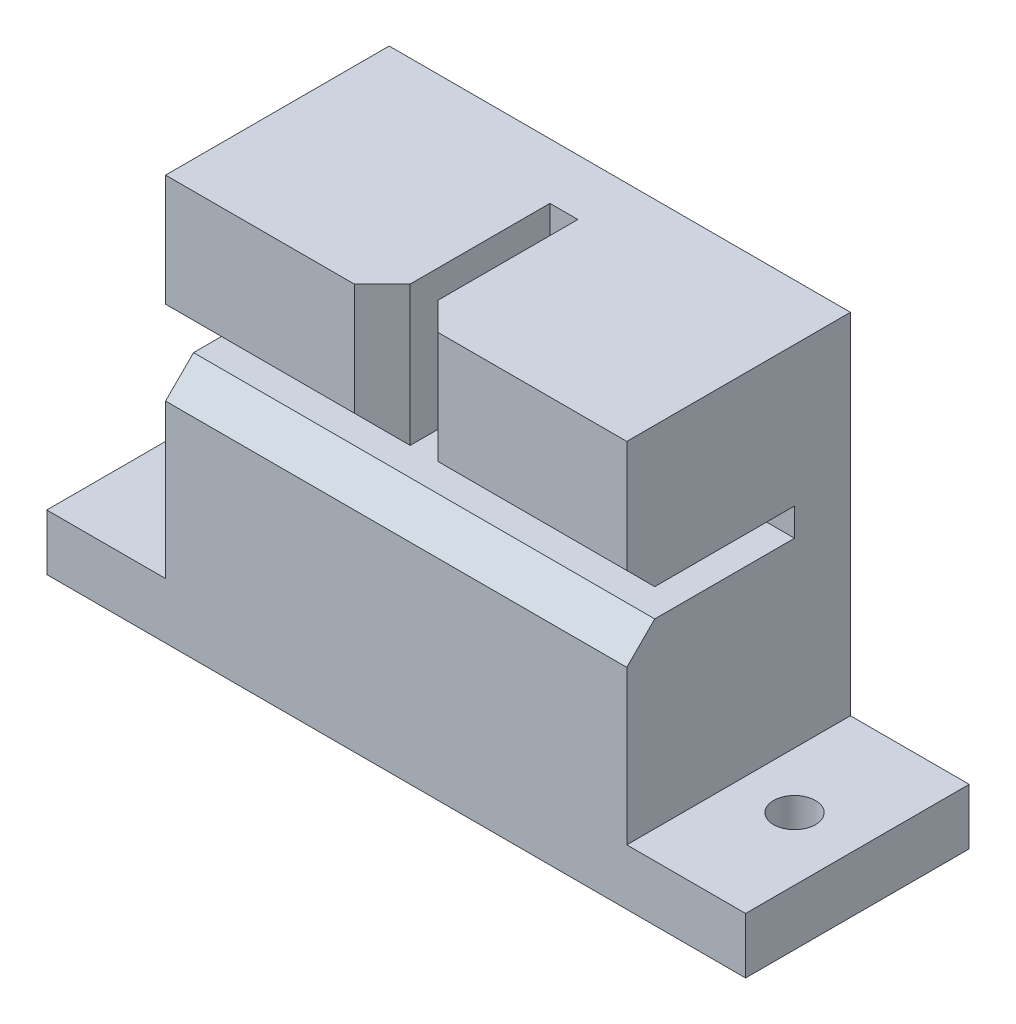
ISO-10303-21;
HEADER;
FILE_DESCRIPTION(('STEP AP214'),'2;1');
FILE_NAME('part.step','',(''),(''),'','','');
FILE_SCHEMA(('AUTOMOTIVE_DESIGN { 1 0 10303 214 1 1 1 1 }'));
ENDSEC;
DATA;
#1=APPLICATION_CONTEXT('core data for automotive mechanical design processes');
#2=APPLICATION_PROTOCOL_DEFINITION('international standard','automotive_design',2000,#1);
#3=PRODUCT_CONTEXT('',#1,'mechanical');
#4=PRODUCT('Part','Part','',(#3));
#5=PRODUCT_RELATED_PRODUCT_CATEGORY('part','',(#4));
#6=PRODUCT_DEFINITION_FORMATION('','',#4);
#7=PRODUCT_DEFINITION_CONTEXT('part definition',#1,'design');
#8=PRODUCT_DEFINITION('design','',#6,#7);
#9=PRODUCT_DEFINITION_SHAPE('','',#8);
#10=(LENGTH_UNIT() NAMED_UNIT(*) SI_UNIT(.MILLI.,.METRE.));
#11=(NAMED_UNIT(*) PLANE_ANGLE_UNIT() SI_UNIT($,.RADIAN.));
#12=(NAMED_UNIT(*) SI_UNIT($,.STERADIAN.) SOLID_ANGLE_UNIT());
#13=UNCERTAINTY_MEASURE_WITH_UNIT(LENGTH_MEASURE(1.E-05),#10,'distance_accuracy_value','');
#14=(GEOMETRIC_REPRESENTATION_CONTEXT(3) GLOBAL_UNCERTAINTY_ASSIGNED_CONTEXT((#13)) GLOBAL_UNIT_ASSIGNED_CONTEXT((#10,
#11,#12)) REPRESENTATION_CONTEXT('',''));
#15=CARTESIAN_POINT('',(0.,0.,0.));
#16=DIRECTION('',(0.,0.,1.));
#17=DIRECTION('',(1.,0.,0.));
#18=AXIS2_PLACEMENT_3D('',#15,#16,#17);
#19=CARTESIAN_POINT('',(0.,14.5,-16.));
#20=DIRECTION('',(0.,-1.,0.));
#21=DIRECTION('',(0.,0.,-1.));
#22=AXIS2_PLACEMENT_3D('',#19,#20,#21);
#23=PLANE('',#22);
#24=DIRECTION('',(0.,0.,1.));
#25=VECTOR('',#24,1.);
#26=CARTESIAN_POINT('',(1.,14.5,-12.));
#27=LINE('',#26,#25);
#28=CARTESIAN_POINT('',(1.,14.5,-12.));
#29=VERTEX_POINT('',#28);
#30=CARTESIAN_POINT('',(1.,14.5,-2.));
#31=VERTEX_POINT('',#30);
#32=EDGE_CURVE('E218',#29,#31,#27,.T.);
#33=ORIENTED_EDGE('',*,*,#32,.T.);
#34=DIRECTION('',(0.707106781186546,0.,0.707106781186549));
#35=VECTOR('',#34,1.);
#36=CARTESIAN_POINT('',(1.,14.5,-2.));
#37=LINE('',#36,#35);
#38=CARTESIAN_POINT('',(2.99999999999999,14.5,0.));
#39=VERTEX_POINT('',#38);
#40=EDGE_CURVE('E302',#31,#39,#37,.T.);
#41=ORIENTED_EDGE('',*,*,#40,.T.);
#42=DIRECTION('',(1.,0.,0.));
#43=VECTOR('',#42,1.);
#44=CARTESIAN_POINT('',(0.,14.5,0.));
#45=LINE('',#44,#43);
#46=CARTESIAN_POINT('',(16.5,14.5,0.));
#47=VERTEX_POINT('',#46);
#48=EDGE_CURVE('E261',#39,#47,#45,.T.);
#49=ORIENTED_EDGE('',*,*,#48,.T.);
#50=DIRECTION('',(0.,0.,1.));
#51=VECTOR('',#50,1.);
#52=CARTESIAN_POINT('',(16.5,14.5,-16.));
#53=LINE('',#52,#51);
#54=CARTESIAN_POINT('',(16.5,14.5,-16.));
#55=VERTEX_POINT('',#54);
#56=EDGE_CURVE('E293',#55,#47,#53,.T.);
#57=ORIENTED_EDGE('',*,*,#56,.F.);
#58=DIRECTION('',(1.,0.,0.));
#59=VECTOR('',#58,1.);
#60=CARTESIAN_POINT('',(0.,14.5,-16.));
#61=LINE('',#60,#59);
#62=CARTESIAN_POINT('',(-16.5,14.5,-16.));
#63=VERTEX_POINT('',#62);
#64=EDGE_CURVE('E239',#63,#55,#61,.T.);
#65=ORIENTED_EDGE('',*,*,#64,.F.);
#66=DIRECTION('',(0.,0.,1.));
#67=VECTOR('',#66,1.);
#68=CARTESIAN_POINT('',(-16.5,14.5,-16.));
#69=LINE('',#68,#67);
#70=CARTESIAN_POINT('',(-16.5,14.5,0.));
#71=VERTEX_POINT('',#70);
#72=EDGE_CURVE('E291',#63,#71,#69,.T.);
#73=ORIENTED_EDGE('',*,*,#72,.T.);
#74=CARTESIAN_POINT('',(-3.,14.5,0.));
#75=VERTEX_POINT('',#74);
#76=EDGE_CURVE('E262',#71,#75,#45,.T.);
#77=ORIENTED_EDGE('',*,*,#76,.T.);
#78=DIRECTION('',(-0.707106781186546,0.,0.707106781186549));
#79=VECTOR('',#78,1.);
#80=CARTESIAN_POINT('',(-3.,14.5,0.));
#81=LINE('',#80,#79);
#82=CARTESIAN_POINT('',(-1.,14.5,-2.));
#83=VERTEX_POINT('',#82);
#84=EDGE_CURVE('E300',#75,#83,#81,.F.);
#85=ORIENTED_EDGE('',*,*,#84,.T.);
#86=DIRECTION('',(0.,0.,1.));
#87=VECTOR('',#86,1.);
#88=CARTESIAN_POINT('',(-1.,14.5,-12.));
#89=LINE('',#88,#87);
#90=CARTESIAN_POINT('',(-1.,14.5,-12.));
#91=VERTEX_POINT('',#90);
#92=EDGE_CURVE('E215',#91,#83,#89,.T.);
#93=ORIENTED_EDGE('',*,*,#92,.F.);
#94=DIRECTION('',(-1.,0.,0.));
#95=VECTOR('',#94,1.);
#96=CARTESIAN_POINT('',(0.,14.5,-12.));
#97=LINE('',#96,#95);
#98=EDGE_CURVE('E190',#29,#91,#97,.T.);
#99=ORIENTED_EDGE('',*,*,#98,.F.);
#100=EDGE_LOOP('',(#33,#41,#49,#57,#65,#73,#77,#85,#93,#99));
#101=FACE_BOUND('',#100,.T.);
#102=ADVANCED_FACE('F35',(#101),#23,.F.);
#103=CARTESIAN_POINT('',(16.5,0.,-16.));
#104=DIRECTION('',(-1.,0.,0.));
#105=DIRECTION('',(0.,0.,1.));
#106=AXIS2_PLACEMENT_3D('',#103,#104,#105);
#107=PLANE('',#106);
#108=DIRECTION('',(0.,-1.,0.));
#109=VECTOR('',#108,1.);
#110=CARTESIAN_POINT('',(16.5,0.,0.));
#111=LINE('',#110,#109);
#112=CARTESIAN_POINT('',(16.5,6.49999999999999,0.));
#113=VERTEX_POINT('',#112);
#114=EDGE_CURVE('E258',#47,#113,#111,.T.);
#115=ORIENTED_EDGE('',*,*,#114,.T.);
#116=DIRECTION('',(0.,0.707106781186546,0.707106781186549));
#117=VECTOR('',#116,1.);
#118=CARTESIAN_POINT('',(16.5,6.49999999999999,0.));
#119=LINE('',#118,#117);
#120=CARTESIAN_POINT('',(16.5,4.5,-2.));
#121=VERTEX_POINT('',#120);
#122=EDGE_CURVE('E310',#113,#121,#119,.F.);
#123=ORIENTED_EDGE('',*,*,#122,.T.);
#124=DIRECTION('',(0.,0.,1.));
#125=VECTOR('',#124,1.);
#126=CARTESIAN_POINT('',(16.5,4.5,-12.));
#127=LINE('',#126,#125);
#128=CARTESIAN_POINT('',(16.5,4.5,-12.));
#129=VERTEX_POINT('',#128);
#130=EDGE_CURVE('E224',#129,#121,#127,.T.);
#131=ORIENTED_EDGE('',*,*,#130,.F.);
#132=DIRECTION('',(0.,1.,0.));
#133=VECTOR('',#132,1.);
#134=CARTESIAN_POINT('',(16.5,0.,-12.));
#135=LINE('',#134,#133);
#136=CARTESIAN_POINT('',(16.5,2.5,-12.));
#137=VERTEX_POINT('',#136);
#138=EDGE_CURVE('E207',#137,#129,#135,.T.);
#139=ORIENTED_EDGE('',*,*,#138,.F.);
#140=DIRECTION('',(0.,0.,1.));
#141=VECTOR('',#140,1.);
#142=CARTESIAN_POINT('',(16.5,2.5,-12.));
#143=LINE('',#142,#141);
#144=CARTESIAN_POINT('',(16.5,2.5,-1.99999999999999));
#145=VERTEX_POINT('',#144);
#146=EDGE_CURVE('E227',#137,#145,#143,.T.);
#147=ORIENTED_EDGE('',*,*,#146,.T.);
#148=DIRECTION('',(0.,-0.707106781186549,0.707106781186546));
#149=VECTOR('',#148,1.);
#150=CARTESIAN_POINT('',(16.5,2.5,-1.99999999999999));
#151=LINE('',#150,#149);
#152=CARTESIAN_POINT('',(16.5,0.499999999999995,0.));
#153=VERTEX_POINT('',#152);
#154=EDGE_CURVE('E308',#145,#153,#151,.T.);
#155=ORIENTED_EDGE('',*,*,#154,.T.);
#156=CARTESIAN_POINT('',(16.5,-10.5,0.));
#157=VERTEX_POINT('',#156);
#158=EDGE_CURVE('E257',#153,#157,#111,.T.);
#159=ORIENTED_EDGE('',*,*,#158,.T.);
#160=DIRECTION('',(0.,0.,1.));
#161=VECTOR('',#160,1.);
#162=CARTESIAN_POINT('',(16.5,-10.5,-16.));
#163=LINE('',#162,#161);
#164=CARTESIAN_POINT('',(16.5,-10.5,-16.));
#165=VERTEX_POINT('',#164);
#166=EDGE_CURVE('E254',#165,#157,#163,.T.);
#167=ORIENTED_EDGE('',*,*,#166,.F.);
#168=DIRECTION('',(0.,-1.,0.));
#169=VECTOR('',#168,1.);
#170=CARTESIAN_POINT('',(16.5,0.,-16.));
#171=LINE('',#170,#169);
#172=EDGE_CURVE('E236',#55,#165,#171,.T.);
#173=ORIENTED_EDGE('',*,*,#172,.F.);
#174=ORIENTED_EDGE('',*,*,#56,.T.);
#175=EDGE_LOOP('',(#115,#123,#131,#139,#147,#155,#159,#167,#173,#174));
#176=FACE_BOUND('',#175,.T.);
#177=ADVANCED_FACE('F393',(#176),#107,.F.);
#178=CARTESIAN_POINT('',(0.,0.,0.));
#179=DIRECTION('',(0.,0.,1.));
#180=DIRECTION('',(1.,0.,0.));
#181=AXIS2_PLACEMENT_3D('',#178,#179,#180);
#182=PLANE('',#181);
#183=ORIENTED_EDGE('',*,*,#48,.F.);
#184=DIRECTION('',(0.,-1.,0.));
#185=VECTOR('',#184,1.);
#186=CARTESIAN_POINT('',(2.99999999999999,4.5,0.));
#187=LINE('',#186,#185);
#188=CARTESIAN_POINT('',(2.99999999999999,6.49999999999999,0.));
#189=VERTEX_POINT('',#188);
#190=EDGE_CURVE('E306',#39,#189,#187,.T.);
#191=ORIENTED_EDGE('',*,*,#190,.T.);
#192=DIRECTION('',(1.,0.,0.));
#193=VECTOR('',#192,1.);
#194=CARTESIAN_POINT('',(0.,6.49999999999999,0.));
#195=LINE('',#194,#193);
#196=EDGE_CURVE('E304',#189,#113,#195,.T.);
#197=ORIENTED_EDGE('',*,*,#196,.T.);
#198=ORIENTED_EDGE('',*,*,#114,.F.);
#199=EDGE_LOOP('',(#183,#191,#197,#198));
#200=FACE_BOUND('',#199,.T.);
#201=ADVANCED_FACE('F424',(#200),#182,.T.);
#202=DIRECTION('',(1.,0.,0.));
#203=VECTOR('',#202,1.);
#204=CARTESIAN_POINT('',(0.,6.49999999999999,0.));
#205=LINE('',#204,#203);
#206=CARTESIAN_POINT('',(-16.5,6.49999999999999,0.));
#207=VERTEX_POINT('',#206);
#208=CARTESIAN_POINT('',(-3.,6.49999999999999,0.));
#209=VERTEX_POINT('',#208);
#210=EDGE_CURVE('E59',#207,#209,#205,.T.);
#211=ORIENTED_EDGE('',*,*,#210,.T.);
#212=DIRECTION('',(0.,1.,0.));
#213=VECTOR('',#212,1.);
#214=CARTESIAN_POINT('',(-3.,0.,0.));
#215=LINE('',#214,#213);
#216=EDGE_CURVE('E324',#209,#75,#215,.T.);
#217=ORIENTED_EDGE('',*,*,#216,.T.);
#218=ORIENTED_EDGE('',*,*,#76,.F.);
#219=DIRECTION('',(0.,-1.,0.));
#220=VECTOR('',#219,1.);
#221=CARTESIAN_POINT('',(-16.5,0.,0.));
#222=LINE('',#221,#220);
#223=EDGE_CURVE('E266',#71,#207,#222,.T.);
#224=ORIENTED_EDGE('',*,*,#223,.T.);
#225=EDGE_LOOP('',(#211,#217,#218,#224));
#226=FACE_BOUND('',#225,.T.);
#227=ADVANCED_FACE('F328',(#226),#182,.T.);
#228=CARTESIAN_POINT('',(0.,-10.5,-16.));
#229=DIRECTION('',(0.,-1.,0.));
#230=DIRECTION('',(0.,0.,-1.));
#231=AXIS2_PLACEMENT_3D('',#228,#229,#230);
#232=PLANE('',#231);
#233=CARTESIAN_POINT('',(20.5,-10.5,-7.99999999999999));
#234=DIRECTION('',(0.,-1.,0.));
#235=DIRECTION('',(0.,0.,-1.));
#236=AXIS2_PLACEMENT_3D('',#233,#234,#235);
#237=CIRCLE('',#236,1.5);
#238=CARTESIAN_POINT('',(20.5,-10.5,-9.5));
#239=VERTEX_POINT('',#238);
#240=EDGE_CURVE('E346',#239,#239,#237,.F.);
#241=ORIENTED_EDGE('',*,*,#240,.F.);
#242=EDGE_LOOP('',(#241));
#243=FACE_BOUND('',#242,.T.);
#244=DIRECTION('',(1.,0.,0.));
#245=VECTOR('',#244,1.);
#246=CARTESIAN_POINT('',(0.,-10.5,0.));
#247=LINE('',#246,#245);
#248=CARTESIAN_POINT('',(25.,-10.5,0.));
#249=VERTEX_POINT('',#248);
#250=EDGE_CURVE('E217',#157,#249,#247,.T.);
#251=ORIENTED_EDGE('',*,*,#250,.T.);
#252=DIRECTION('',(0.,0.,1.));
#253=VECTOR('',#252,1.);
#254=CARTESIAN_POINT('',(25.,-10.5,-16.));
#255=LINE('',#254,#253);
#256=CARTESIAN_POINT('',(25.,-10.5,-16.));
#257=VERTEX_POINT('',#256);
#258=EDGE_CURVE('E278',#257,#249,#255,.T.);
#259=ORIENTED_EDGE('',*,*,#258,.F.);
#260=DIRECTION('',(1.,0.,0.));
#261=VECTOR('',#260,1.);
#262=CARTESIAN_POINT('',(0.,-10.5,-16.));
#263=LINE('',#262,#261);
#264=EDGE_CURVE('E234',#165,#257,#263,.T.);
#265=ORIENTED_EDGE('',*,*,#264,.F.);
#266=ORIENTED_EDGE('',*,*,#166,.T.);
#267=EDGE_LOOP('',(#251,#259,#265,#266));
#268=FACE_BOUND('',#267,.T.);
#269=ADVANCED_FACE('F379',(#243,#268),#232,.F.);
#270=CARTESIAN_POINT('',(25.,0.,-16.));
#271=DIRECTION('',(1.,0.,0.));
#272=DIRECTION('',(0.,0.,-1.));
#273=AXIS2_PLACEMENT_3D('',#270,#271,#272);
#274=PLANE('',#273);
#275=DIRECTION('',(0.,1.,0.));
#276=VECTOR('',#275,1.);
#277=CARTESIAN_POINT('',(25.,0.,0.));
#278=LINE('',#277,#276);
#279=CARTESIAN_POINT('',(25.,-14.5,0.));
#280=VERTEX_POINT('',#279);
#281=EDGE_CURVE('E237',#280,#249,#278,.T.);
#282=ORIENTED_EDGE('',*,*,#281,.F.);
#283=DIRECTION('',(0.,0.,1.));
#284=VECTOR('',#283,1.);
#285=CARTESIAN_POINT('',(25.,-14.5,-16.));
#286=LINE('',#285,#284);
#287=CARTESIAN_POINT('',(25.,-14.5,-16.));
#288=VERTEX_POINT('',#287);
#289=EDGE_CURVE('E281',#288,#280,#286,.T.);
#290=ORIENTED_EDGE('',*,*,#289,.F.);
#291=DIRECTION('',(0.,1.,0.));
#292=VECTOR('',#291,1.);
#293=CARTESIAN_POINT('',(25.,0.,-16.));
#294=LINE('',#293,#292);
#295=EDGE_CURVE('E251',#288,#257,#294,.T.);
#296=ORIENTED_EDGE('',*,*,#295,.T.);
#297=ORIENTED_EDGE('',*,*,#258,.T.);
#298=EDGE_LOOP('',(#282,#290,#296,#297));
#299=FACE_BOUND('',#298,.T.);
#300=ADVANCED_FACE('F362',(#299),#274,.T.);
#301=CARTESIAN_POINT('',(0.,-14.5,-16.));
#302=DIRECTION('',(0.,-1.,0.));
#303=DIRECTION('',(0.,0.,-1.));
#304=AXIS2_PLACEMENT_3D('',#301,#302,#303);
#305=PLANE('',#304);
#306=CARTESIAN_POINT('',(20.5,-14.5,-7.99999999999999));
#307=DIRECTION('',(0.,-1.,0.));
#308=DIRECTION('',(0.,0.,1.));
#309=AXIS2_PLACEMENT_3D('',#306,#307,#308);
#310=CIRCLE('',#309,1.5);
#311=CARTESIAN_POINT('',(20.5,-14.5,-6.49999999999999));
#312=VERTEX_POINT('',#311);
#313=EDGE_CURVE('E350',#312,#312,#310,.T.);
#314=ORIENTED_EDGE('',*,*,#313,.F.);
#315=EDGE_LOOP('',(#314));
#316=FACE_BOUND('',#315,.T.);
#317=CARTESIAN_POINT('',(-20.5,-14.5,-8.));
#318=DIRECTION('',(0.,-1.,0.));
#319=DIRECTION('',(0.,0.,-1.));
#320=AXIS2_PLACEMENT_3D('',#317,#318,#319);
#321=CIRCLE('',#320,1.5);
#322=CARTESIAN_POINT('',(-20.5,-14.5,-9.5));
#323=VERTEX_POINT('',#322);
#324=EDGE_CURVE('E342',#323,#323,#321,.T.);
#325=ORIENTED_EDGE('',*,*,#324,.F.);
#326=EDGE_LOOP('',(#325));
#327=FACE_BOUND('',#326,.T.);
#328=DIRECTION('',(1.,0.,0.));
#329=VECTOR('',#328,1.);
#330=CARTESIAN_POINT('',(0.,-14.5,0.));
#331=LINE('',#330,#329);
#332=CARTESIAN_POINT('',(-25.,-14.5,0.));
#333=VERTEX_POINT('',#332);
#334=EDGE_CURVE('E273',#333,#280,#331,.T.);
#335=ORIENTED_EDGE('',*,*,#334,.F.);
#336=DIRECTION('',(0.,0.,1.));
#337=VECTOR('',#336,1.);
#338=CARTESIAN_POINT('',(-25.,-14.5,-16.));
#339=LINE('',#338,#337);
#340=CARTESIAN_POINT('',(-25.,-14.5,-16.));
#341=VERTEX_POINT('',#340);
#342=EDGE_CURVE('E283',#341,#333,#339,.T.);
#343=ORIENTED_EDGE('',*,*,#342,.F.);
#344=DIRECTION('',(1.,0.,0.));
#345=VECTOR('',#344,1.);
#346=CARTESIAN_POINT('',(0.,-14.5,-16.));
#347=LINE('',#346,#345);
#348=EDGE_CURVE('E248',#341,#288,#347,.T.);
#349=ORIENTED_EDGE('',*,*,#348,.T.);
#350=ORIENTED_EDGE('',*,*,#289,.T.);
#351=EDGE_LOOP('',(#335,#343,#349,#350));
#352=FACE_BOUND('',#351,.T.);
#353=ADVANCED_FACE('F358',(#316,#327,#352),#305,.T.);
#354=CARTESIAN_POINT('',(-25.,0.,-16.));
#355=DIRECTION('',(1.,0.,0.));
#356=DIRECTION('',(0.,0.,-1.));
#357=AXIS2_PLACEMENT_3D('',#354,#355,#356);
#358=PLANE('',#357);
#359=DIRECTION('',(0.,1.,0.));
#360=VECTOR('',#359,1.);
#361=CARTESIAN_POINT('',(-25.,0.,0.));
#362=LINE('',#361,#360);
#363=CARTESIAN_POINT('',(-25.,-10.5,0.));
#364=VERTEX_POINT('',#363);
#365=EDGE_CURVE('E271',#333,#364,#362,.T.);
#366=ORIENTED_EDGE('',*,*,#365,.T.);
#367=DIRECTION('',(0.,0.,1.));
#368=VECTOR('',#367,1.);
#369=CARTESIAN_POINT('',(-25.,-10.5,-16.));
#370=LINE('',#369,#368);
#371=CARTESIAN_POINT('',(-25.,-10.5,-16.));
#372=VERTEX_POINT('',#371);
#373=EDGE_CURVE('E285',#372,#364,#370,.T.);
#374=ORIENTED_EDGE('',*,*,#373,.F.);
#375=DIRECTION('',(0.,1.,0.));
#376=VECTOR('',#375,1.);
#377=CARTESIAN_POINT('',(-25.,0.,-16.));
#378=LINE('',#377,#376);
#379=EDGE_CURVE('E246',#341,#372,#378,.T.);
#380=ORIENTED_EDGE('',*,*,#379,.F.);
#381=ORIENTED_EDGE('',*,*,#342,.T.);
#382=EDGE_LOOP('',(#366,#374,#380,#381));
#383=FACE_BOUND('',#382,.T.);
#384=ADVANCED_FACE('F361',(#383),#358,.F.);
#385=CARTESIAN_POINT('',(0.,-10.5,-16.));
#386=DIRECTION('',(0.,-1.,0.));
#387=DIRECTION('',(0.,0.,-1.));
#388=AXIS2_PLACEMENT_3D('',#385,#386,#387);
#389=PLANE('',#388);
#390=CARTESIAN_POINT('',(-20.5,-10.5,-8.));
#391=DIRECTION('',(0.,-1.,0.));
#392=DIRECTION('',(0.,0.,-1.));
#393=AXIS2_PLACEMENT_3D('',#390,#391,#392);
#394=CIRCLE('',#393,1.5);
#395=CARTESIAN_POINT('',(-20.5,-10.5,-9.5));
#396=VERTEX_POINT('',#395);
#397=EDGE_CURVE('E200',#396,#396,#394,.F.);
#398=ORIENTED_EDGE('',*,*,#397,.F.);
#399=EDGE_LOOP('',(#398));
#400=FACE_BOUND('',#399,.T.);
#401=DIRECTION('',(1.,0.,0.));
#402=VECTOR('',#401,1.);
#403=CARTESIAN_POINT('',(0.,-10.5,0.));
#404=LINE('',#403,#402);
#405=CARTESIAN_POINT('',(-16.5,-10.5,0.));
#406=VERTEX_POINT('',#405);
#407=EDGE_CURVE('E268',#364,#406,#404,.T.);
#408=ORIENTED_EDGE('',*,*,#407,.T.);
#409=DIRECTION('',(0.,0.,1.));
#410=VECTOR('',#409,1.);
#411=CARTESIAN_POINT('',(-16.5,-10.5,-16.));
#412=LINE('',#411,#410);
#413=CARTESIAN_POINT('',(-16.5,-10.5,-16.));
#414=VERTEX_POINT('',#413);
#415=EDGE_CURVE('E288',#414,#406,#412,.T.);
#416=ORIENTED_EDGE('',*,*,#415,.F.);
#417=DIRECTION('',(1.,0.,0.));
#418=VECTOR('',#417,1.);
#419=CARTESIAN_POINT('',(0.,-10.5,-16.));
#420=LINE('',#419,#418);
#421=EDGE_CURVE('E244',#372,#414,#420,.T.);
#422=ORIENTED_EDGE('',*,*,#421,.F.);
#423=ORIENTED_EDGE('',*,*,#373,.T.);
#424=EDGE_LOOP('',(#408,#416,#422,#423));
#425=FACE_BOUND('',#424,.T.);
#426=ADVANCED_FACE('F472',(#400,#425),#389,.F.);
#427=CARTESIAN_POINT('',(-16.5,0.,-16.));
#428=DIRECTION('',(-1.,0.,0.));
#429=DIRECTION('',(0.,0.,1.));
#430=AXIS2_PLACEMENT_3D('',#427,#428,#429);
#431=PLANE('',#430);
#432=CARTESIAN_POINT('',(-16.5,0.499999999999998,0.));
#433=VERTEX_POINT('',#432);
#434=EDGE_CURVE('E265',#433,#406,#222,.T.);
#435=ORIENTED_EDGE('',*,*,#434,.F.);
#436=DIRECTION('',(0.,0.707106781186549,-0.707106781186546));
#437=VECTOR('',#436,1.);
#438=CARTESIAN_POINT('',(-16.5,8.25,-7.74999999999997));
#439=LINE('',#438,#437);
#440=CARTESIAN_POINT('',(-16.5,2.5,-1.99999999999999));
#441=VERTEX_POINT('',#440);
#442=EDGE_CURVE('E321',#433,#441,#439,.T.);
#443=ORIENTED_EDGE('',*,*,#442,.T.);
#444=DIRECTION('',(0.,0.,1.));
#445=VECTOR('',#444,1.);
#446=CARTESIAN_POINT('',(-16.5,2.5,-12.));
#447=LINE('',#446,#445);
#448=CARTESIAN_POINT('',(-16.5,2.5,-12.));
#449=VERTEX_POINT('',#448);
#450=EDGE_CURVE('E230',#449,#441,#447,.T.);
#451=ORIENTED_EDGE('',*,*,#450,.F.);
#452=DIRECTION('',(0.,-1.,0.));
#453=VECTOR('',#452,1.);
#454=CARTESIAN_POINT('',(-16.5,0.,-12.));
#455=LINE('',#454,#453);
#456=CARTESIAN_POINT('',(-16.5,4.5,-12.));
#457=VERTEX_POINT('',#456);
#458=EDGE_CURVE('E185',#457,#449,#455,.T.);
#459=ORIENTED_EDGE('',*,*,#458,.F.);
#460=DIRECTION('',(0.,0.,1.));
#461=VECTOR('',#460,1.);
#462=CARTESIAN_POINT('',(-16.5,4.5,-12.));
#463=LINE('',#462,#461);
#464=CARTESIAN_POINT('',(-16.5,4.5,-2.));
#465=VERTEX_POINT('',#464);
#466=EDGE_CURVE('E180',#457,#465,#463,.T.);
#467=ORIENTED_EDGE('',*,*,#466,.T.);
#468=DIRECTION('',(0.,-0.707106781186546,-0.707106781186549));
#469=VECTOR('',#468,1.);
#470=CARTESIAN_POINT('',(-16.5,-4.74999999999999,-11.25));
#471=LINE('',#470,#469);
#472=EDGE_CURVE('E319',#465,#207,#471,.F.);
#473=ORIENTED_EDGE('',*,*,#472,.T.);
#474=ORIENTED_EDGE('',*,*,#223,.F.);
#475=ORIENTED_EDGE('',*,*,#72,.F.);
#476=DIRECTION('',(0.,-1.,0.));
#477=VECTOR('',#476,1.);
#478=CARTESIAN_POINT('',(-16.5,0.,-16.));
#479=LINE('',#478,#477);
#480=EDGE_CURVE('E241',#63,#414,#479,.T.);
#481=ORIENTED_EDGE('',*,*,#480,.T.);
#482=ORIENTED_EDGE('',*,*,#415,.T.);
#483=EDGE_LOOP('',(#435,#443,#451,#459,#467,#473,#474,#475,#481,#482));
#484=FACE_BOUND('',#483,.T.);
#485=ADVANCED_FACE('F338',(#484),#431,.T.);
#486=CARTESIAN_POINT('',(0.,0.,-16.));
#487=DIRECTION('',(0.,0.,1.));
#488=DIRECTION('',(1.,0.,0.));
#489=AXIS2_PLACEMENT_3D('',#486,#487,#488);
#490=PLANE('',#489);
#491=ORIENTED_EDGE('',*,*,#264,.T.);
#492=ORIENTED_EDGE('',*,*,#295,.F.);
#493=ORIENTED_EDGE('',*,*,#348,.F.);
#494=ORIENTED_EDGE('',*,*,#379,.T.);
#495=ORIENTED_EDGE('',*,*,#421,.T.);
#496=ORIENTED_EDGE('',*,*,#480,.F.);
#497=ORIENTED_EDGE('',*,*,#64,.T.);
#498=ORIENTED_EDGE('',*,*,#172,.T.);
#499=EDGE_LOOP('',(#491,#492,#493,#494,#495,#496,#497,#498));
#500=FACE_BOUND('',#499,.T.);
#501=ADVANCED_FACE('F509',(#500),#490,.F.);
#502=ORIENTED_EDGE('',*,*,#158,.F.);
#503=DIRECTION('',(-1.,0.,0.));
#504=VECTOR('',#503,1.);
#505=CARTESIAN_POINT('',(-16.5,0.499999999999995,0.));
#506=LINE('',#505,#504);
#507=EDGE_CURVE('E317',#153,#433,#506,.T.);
#508=ORIENTED_EDGE('',*,*,#507,.T.);
#509=ORIENTED_EDGE('',*,*,#434,.T.);
#510=ORIENTED_EDGE('',*,*,#407,.F.);
#511=ORIENTED_EDGE('',*,*,#365,.F.);
#512=ORIENTED_EDGE('',*,*,#334,.T.);
#513=ORIENTED_EDGE('',*,*,#281,.T.);
#514=ORIENTED_EDGE('',*,*,#250,.F.);
#515=EDGE_LOOP('',(#502,#508,#509,#510,#511,#512,#513,#514));
#516=FACE_BOUND('',#515,.T.);
#517=ADVANCED_FACE('F371',(#516),#182,.T.);
#518=CARTESIAN_POINT('',(-1.,0.,-12.));
#519=DIRECTION('',(1.,0.,0.));
#520=DIRECTION('',(0.,0.,-1.));
#521=AXIS2_PLACEMENT_3D('',#518,#519,#520);
#522=PLANE('',#521);
#523=ORIENTED_EDGE('',*,*,#92,.T.);
#524=DIRECTION('',(0.,-1.,0.));
#525=VECTOR('',#524,1.);
#526=CARTESIAN_POINT('',(-1.,0.,-2.));
#527=LINE('',#526,#525);
#528=CARTESIAN_POINT('',(-1.,4.5,-2.));
#529=VERTEX_POINT('',#528);
#530=EDGE_CURVE('E44',#83,#529,#527,.T.);
#531=ORIENTED_EDGE('',*,*,#530,.T.);
#532=DIRECTION('',(0.,0.,1.));
#533=VECTOR('',#532,1.);
#534=CARTESIAN_POINT('',(-1.,4.5,-12.));
#535=LINE('',#534,#533);
#536=CARTESIAN_POINT('',(-1.,4.5,-12.));
#537=VERTEX_POINT('',#536);
#538=EDGE_CURVE('E177',#537,#529,#535,.T.);
#539=ORIENTED_EDGE('',*,*,#538,.F.);
#540=DIRECTION('',(0.,1.,0.));
#541=VECTOR('',#540,1.);
#542=CARTESIAN_POINT('',(-1.,0.,-12.));
#543=LINE('',#542,#541);
#544=EDGE_CURVE('E186',#537,#91,#543,.T.);
#545=ORIENTED_EDGE('',*,*,#544,.T.);
#546=EDGE_LOOP('',(#523,#531,#539,#545));
#547=FACE_BOUND('',#546,.T.);
#548=ADVANCED_FACE('F188',(#547),#522,.T.);
#549=CARTESIAN_POINT('',(1.,0.,-12.));
#550=DIRECTION('',(1.,0.,0.));
#551=DIRECTION('',(0.,1.,0.));
#552=AXIS2_PLACEMENT_3D('',#549,#550,#551);
#553=PLANE('',#552);
#554=DIRECTION('',(0.,0.,1.));
#555=VECTOR('',#554,1.);
#556=CARTESIAN_POINT('',(1.,4.5,-12.));
#557=LINE('',#556,#555);
#558=CARTESIAN_POINT('',(1.,4.5,-12.));
#559=VERTEX_POINT('',#558);
#560=CARTESIAN_POINT('',(1.,4.5,-2.));
#561=VERTEX_POINT('',#560);
#562=EDGE_CURVE('E221',#559,#561,#557,.T.);
#563=ORIENTED_EDGE('',*,*,#562,.T.);
#564=DIRECTION('',(0.,1.,0.));
#565=VECTOR('',#564,1.);
#566=CARTESIAN_POINT('',(1.,14.5,-2.));
#567=LINE('',#566,#565);
#568=EDGE_CURVE('E280',#561,#31,#567,.T.);
#569=ORIENTED_EDGE('',*,*,#568,.T.);
#570=ORIENTED_EDGE('',*,*,#32,.F.);
#571=DIRECTION('',(0.,1.,0.));
#572=VECTOR('',#571,1.);
#573=CARTESIAN_POINT('',(1.,0.,-12.));
#574=LINE('',#573,#572);
#575=EDGE_CURVE('E212',#559,#29,#574,.T.);
#576=ORIENTED_EDGE('',*,*,#575,.F.);
#577=EDGE_LOOP('',(#563,#569,#570,#576));
#578=FACE_BOUND('',#577,.T.);
#579=ADVANCED_FACE('F407',(#578),#553,.F.);
#580=CARTESIAN_POINT('',(0.,4.5,-12.));
#581=DIRECTION('',(0.,-1.,0.));
#582=DIRECTION('',(0.,0.,-1.));
#583=AXIS2_PLACEMENT_3D('',#580,#581,#582);
#584=PLANE('',#583);
#585=ORIENTED_EDGE('',*,*,#130,.T.);
#586=DIRECTION('',(-1.,0.,0.));
#587=VECTOR('',#586,1.);
#588=CARTESIAN_POINT('',(0.,4.5,-2.));
#589=LINE('',#588,#587);
#590=EDGE_CURVE('E312',#121,#561,#589,.T.);
#591=ORIENTED_EDGE('',*,*,#590,.T.);
#592=ORIENTED_EDGE('',*,*,#562,.F.);
#593=DIRECTION('',(1.,0.,0.));
#594=VECTOR('',#593,1.);
#595=CARTESIAN_POINT('',(0.,4.5,-12.));
#596=LINE('',#595,#594);
#597=EDGE_CURVE('E210',#559,#129,#596,.T.);
#598=ORIENTED_EDGE('',*,*,#597,.T.);
#599=EDGE_LOOP('',(#585,#591,#592,#598));
#600=FACE_BOUND('',#599,.T.);
#601=ADVANCED_FACE('F397',(#600),#584,.T.);
#602=CARTESIAN_POINT('',(0.,2.5,-12.));
#603=DIRECTION('',(0.,-1.,0.));
#604=DIRECTION('',(0.,0.,-1.));
#605=AXIS2_PLACEMENT_3D('',#602,#603,#604);
#606=PLANE('',#605);
#607=ORIENTED_EDGE('',*,*,#450,.T.);
#608=DIRECTION('',(1.,0.,0.));
#609=VECTOR('',#608,1.);
#610=CARTESIAN_POINT('',(16.5,2.5,-1.99999999999999));
#611=LINE('',#610,#609);
#612=EDGE_CURVE('E314',#441,#145,#611,.T.);
#613=ORIENTED_EDGE('',*,*,#612,.T.);
#614=ORIENTED_EDGE('',*,*,#146,.F.);
#615=DIRECTION('',(1.,0.,0.));
#616=VECTOR('',#615,1.);
#617=CARTESIAN_POINT('',(0.,2.5,-12.));
#618=LINE('',#617,#616);
#619=EDGE_CURVE('E204',#449,#137,#618,.T.);
#620=ORIENTED_EDGE('',*,*,#619,.F.);
#621=EDGE_LOOP('',(#607,#613,#614,#620));
#622=FACE_BOUND('',#621,.T.);
#623=ADVANCED_FACE('F389',(#622),#606,.F.);
#624=CARTESIAN_POINT('',(0.,4.5,-12.));
#625=DIRECTION('',(0.,-1.,0.));
#626=DIRECTION('',(0.,0.,-1.));
#627=AXIS2_PLACEMENT_3D('',#624,#625,#626);
#628=PLANE('',#627);
#629=ORIENTED_EDGE('',*,*,#538,.T.);
#630=DIRECTION('',(-1.,0.,0.));
#631=VECTOR('',#630,1.);
#632=CARTESIAN_POINT('',(0.,4.5,-2.));
#633=LINE('',#632,#631);
#634=EDGE_CURVE('E11',#529,#465,#633,.T.);
#635=ORIENTED_EDGE('',*,*,#634,.T.);
#636=ORIENTED_EDGE('',*,*,#466,.F.);
#637=DIRECTION('',(1.,0.,0.));
#638=VECTOR('',#637,1.);
#639=CARTESIAN_POINT('',(0.,4.5,-12.));
#640=LINE('',#639,#638);
#641=EDGE_CURVE('E175',#457,#537,#640,.T.);
#642=ORIENTED_EDGE('',*,*,#641,.T.);
#643=EDGE_LOOP('',(#629,#635,#636,#642));
#644=FACE_BOUND('',#643,.T.);
#645=ADVANCED_FACE('F176',(#644),#628,.T.);
#646=CARTESIAN_POINT('',(0.,0.,-12.));
#647=DIRECTION('',(0.,0.,1.));
#648=DIRECTION('',(1.,0.,0.));
#649=AXIS2_PLACEMENT_3D('',#646,#647,#648);
#650=PLANE('',#649);
#651=ORIENTED_EDGE('',*,*,#544,.F.);
#652=ORIENTED_EDGE('',*,*,#641,.F.);
#653=ORIENTED_EDGE('',*,*,#458,.T.);
#654=ORIENTED_EDGE('',*,*,#619,.T.);
#655=ORIENTED_EDGE('',*,*,#138,.T.);
#656=ORIENTED_EDGE('',*,*,#597,.F.);
#657=ORIENTED_EDGE('',*,*,#575,.T.);
#658=ORIENTED_EDGE('',*,*,#98,.T.);
#659=EDGE_LOOP('',(#651,#652,#653,#654,#655,#656,#657,#658));
#660=FACE_BOUND('',#659,.T.);
#661=ADVANCED_FACE('F192',(#660),#650,.T.);
#662=CARTESIAN_POINT('',(0.,6.49999999999999,0.));
#663=DIRECTION('',(0.,0.707106781186549,-0.707106781186546));
#664=DIRECTION('',(1.,0.,0.));
#665=AXIS2_PLACEMENT_3D('',#662,#663,#664);
#666=PLANE('',#665);
#667=ORIENTED_EDGE('',*,*,#122,.F.);
#668=ORIENTED_EDGE('',*,*,#196,.F.);
#669=DIRECTION('',(0.577350269189625,0.577350269189625,0.577350269189627));
#670=VECTOR('',#669,1.);
#671=CARTESIAN_POINT('',(2.,5.5,-1.));
#672=LINE('',#671,#670);
#673=EDGE_CURVE('E196',#561,#189,#672,.T.);
#674=ORIENTED_EDGE('',*,*,#673,.F.);
#675=ORIENTED_EDGE('',*,*,#590,.F.);
#676=EDGE_LOOP('',(#667,#668,#674,#675));
#677=FACE_BOUND('',#676,.T.);
#678=ADVANCED_FACE('F400',(#677),#666,.F.);
#679=CARTESIAN_POINT('',(1.,0.,-2.));
#680=DIRECTION('',(-0.707106781186549,0.,0.707106781186546));
#681=DIRECTION('',(0.,-1.,0.));
#682=AXIS2_PLACEMENT_3D('',#679,#680,#681);
#683=PLANE('',#682);
#684=ORIENTED_EDGE('',*,*,#673,.T.);
#685=ORIENTED_EDGE('',*,*,#190,.F.);
#686=ORIENTED_EDGE('',*,*,#40,.F.);
#687=ORIENTED_EDGE('',*,*,#568,.F.);
#688=EDGE_LOOP('',(#684,#685,#686,#687));
#689=FACE_BOUND('',#688,.T.);
#690=ADVANCED_FACE('F405',(#689),#683,.T.);
#691=CARTESIAN_POINT('',(0.,2.5,-1.99999999999999));
#692=DIRECTION('',(0.,0.707106781186546,0.707106781186549));
#693=DIRECTION('',(-1.,0.,0.));
#694=AXIS2_PLACEMENT_3D('',#691,#692,#693);
#695=PLANE('',#694);
#696=ORIENTED_EDGE('',*,*,#442,.F.);
#697=ORIENTED_EDGE('',*,*,#507,.F.);
#698=ORIENTED_EDGE('',*,*,#154,.F.);
#699=ORIENTED_EDGE('',*,*,#612,.F.);
#700=EDGE_LOOP('',(#696,#697,#698,#699));
#701=FACE_BOUND('',#700,.T.);
#702=ADVANCED_FACE('F385',(#701),#695,.T.);
#703=CARTESIAN_POINT('',(0.,6.49999999999999,0.));
#704=DIRECTION('',(0.,0.707106781186549,-0.707106781186546));
#705=DIRECTION('',(1.,0.,0.));
#706=AXIS2_PLACEMENT_3D('',#703,#704,#705);
#707=PLANE('',#706);
#708=ORIENTED_EDGE('',*,*,#472,.F.);
#709=ORIENTED_EDGE('',*,*,#634,.F.);
#710=DIRECTION('',(-0.577350269189625,0.577350269189625,0.577350269189627));
#711=VECTOR('',#710,1.);
#712=CARTESIAN_POINT('',(-2.,5.5,-1.));
#713=LINE('',#712,#711);
#714=EDGE_CURVE('E39',#209,#529,#713,.F.);
#715=ORIENTED_EDGE('',*,*,#714,.F.);
#716=ORIENTED_EDGE('',*,*,#210,.F.);
#717=EDGE_LOOP('',(#708,#709,#715,#716));
#718=FACE_BOUND('',#717,.T.);
#719=ADVANCED_FACE('F37',(#718),#707,.F.);
#720=CARTESIAN_POINT('',(-3.,0.,0.));
#721=DIRECTION('',(-0.707106781186549,0.,-0.707106781186546));
#722=DIRECTION('',(0.,1.,0.));
#723=AXIS2_PLACEMENT_3D('',#720,#721,#722);
#724=PLANE('',#723);
#725=ORIENTED_EDGE('',*,*,#714,.T.);
#726=ORIENTED_EDGE('',*,*,#530,.F.);
#727=ORIENTED_EDGE('',*,*,#84,.F.);
#728=ORIENTED_EDGE('',*,*,#216,.F.);
#729=EDGE_LOOP('',(#725,#726,#727,#728));
#730=FACE_BOUND('',#729,.T.);
#731=ADVANCED_FACE('F410',(#730),#724,.F.);
#732=CARTESIAN_POINT('',(-20.5,-6.25735931288072,-8.));
#733=DIRECTION('',(0.,-1.,0.));
#734=DIRECTION('',(0.,0.,-1.));
#735=AXIS2_PLACEMENT_3D('',#732,#733,#734);
#736=CYLINDRICAL_SURFACE('',#735,1.5);
#737=ORIENTED_EDGE('',*,*,#397,.T.);
#738=EDGE_LOOP('',(#737));
#739=FACE_BOUND('',#738,.T.);
#740=ORIENTED_EDGE('',*,*,#324,.T.);
#741=EDGE_LOOP('',(#740));
#742=FACE_BOUND('',#741,.T.);
#743=ADVANCED_FACE('F412',(#739,#742),#736,.F.);
#744=CARTESIAN_POINT('',(20.5,-6.25735931288072,-7.99999999999999));
#745=DIRECTION('',(0.,-1.,0.));
#746=DIRECTION('',(0.,0.,-1.));
#747=AXIS2_PLACEMENT_3D('',#744,#745,#746);
#748=CYLINDRICAL_SURFACE('',#747,1.5);
#749=ORIENTED_EDGE('',*,*,#240,.T.);
#750=EDGE_LOOP('',(#749));
#751=FACE_BOUND('',#750,.T.);
#752=ORIENTED_EDGE('',*,*,#313,.T.);
#753=EDGE_LOOP('',(#752));
#754=FACE_BOUND('',#753,.T.);
#755=ADVANCED_FACE('F356',(#751,#754),#748,.F.);
#756=CLOSED_SHELL('',(#102,#177,#201,#227,#269,#300,#353,#384,#426,#485,#501,#517,#548,#579,
#601,#623,#645,#661,#678,#690,#702,#719,#731,#743,#755));
#757=MANIFOLD_SOLID_BREP('B2',#756);
#758=ADVANCED_BREP_SHAPE_REPRESENTATION('',(#18,#757),#14);
#759=SHAPE_DEFINITION_REPRESENTATION(#9,#758);
ENDSEC;
END-ISO-10303-21;
